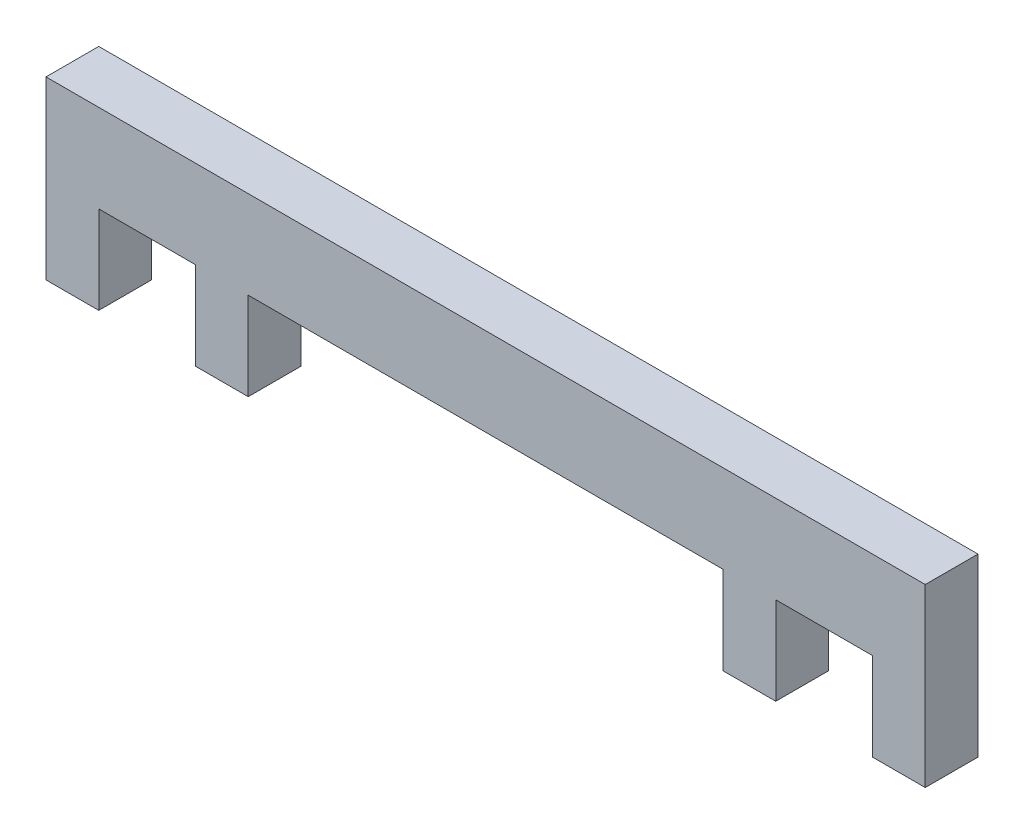
ISO-10303-21;
HEADER;
FILE_DESCRIPTION(('STEP AP214'),'2;1');
FILE_NAME('part.step','',(''),(''),'','','');
FILE_SCHEMA(('AUTOMOTIVE_DESIGN { 1 0 10303 214 1 1 1 1 }'));
ENDSEC;
DATA;
#1=APPLICATION_CONTEXT('core data for automotive mechanical design processes');
#2=APPLICATION_PROTOCOL_DEFINITION('international standard','automotive_design',2000,#1);
#3=PRODUCT_CONTEXT('',#1,'mechanical');
#4=PRODUCT('Part','Part','',(#3));
#5=PRODUCT_RELATED_PRODUCT_CATEGORY('part','',(#4));
#6=PRODUCT_DEFINITION_FORMATION('','',#4);
#7=PRODUCT_DEFINITION_CONTEXT('part definition',#1,'design');
#8=PRODUCT_DEFINITION('design','',#6,#7);
#9=PRODUCT_DEFINITION_SHAPE('','',#8);
#10=(LENGTH_UNIT() NAMED_UNIT(*) SI_UNIT(.MILLI.,.METRE.));
#11=(NAMED_UNIT(*) PLANE_ANGLE_UNIT() SI_UNIT($,.RADIAN.));
#12=(NAMED_UNIT(*) SI_UNIT($,.STERADIAN.) SOLID_ANGLE_UNIT());
#13=UNCERTAINTY_MEASURE_WITH_UNIT(LENGTH_MEASURE(1.E-05),#10,'distance_accuracy_value','');
#14=(GEOMETRIC_REPRESENTATION_CONTEXT(3) GLOBAL_UNCERTAINTY_ASSIGNED_CONTEXT((#13)) GLOBAL_UNIT_ASSIGNED_CONTEXT((#10,
#11,#12)) REPRESENTATION_CONTEXT('',''));
#15=CARTESIAN_POINT('',(0.,0.,0.));
#16=DIRECTION('',(0.,0.,1.));
#17=DIRECTION('',(1.,0.,0.));
#18=AXIS2_PLACEMENT_3D('',#15,#16,#17);
#19=CARTESIAN_POINT('',(0.,5.,3.));
#20=DIRECTION('',(-1.,0.,0.));
#21=DIRECTION('',(0.,-1.,0.));
#22=AXIS2_PLACEMENT_3D('',#19,#20,#21);
#23=PLANE('',#22);
#24=DIRECTION('',(0.,1.,0.));
#25=VECTOR('',#24,1.);
#26=CARTESIAN_POINT('',(0.,5.,0.));
#27=LINE('',#26,#25);
#28=CARTESIAN_POINT('',(0.,0.,0.));
#29=VERTEX_POINT('',#28);
#30=CARTESIAN_POINT('',(0.,5.,0.));
#31=VERTEX_POINT('',#30);
#32=EDGE_CURVE('E194',#29,#31,#27,.T.);
#33=ORIENTED_EDGE('',*,*,#32,.T.);
#34=DIRECTION('',(0.,0.,-1.));
#35=VECTOR('',#34,1.);
#36=CARTESIAN_POINT('',(0.,5.,3.));
#37=LINE('',#36,#35);
#38=CARTESIAN_POINT('',(0.,5.,3.));
#39=VERTEX_POINT('',#38);
#40=EDGE_CURVE('E11',#39,#31,#37,.T.);
#41=ORIENTED_EDGE('',*,*,#40,.F.);
#42=DIRECTION('',(0.,1.,0.));
#43=VECTOR('',#42,1.);
#44=CARTESIAN_POINT('',(0.,5.,3.));
#45=LINE('',#44,#43);
#46=CARTESIAN_POINT('',(0.,0.,3.));
#47=VERTEX_POINT('',#46);
#48=EDGE_CURVE('E240',#47,#39,#45,.T.);
#49=ORIENTED_EDGE('',*,*,#48,.F.);
#50=DIRECTION('',(0.,0.,-1.));
#51=VECTOR('',#50,1.);
#52=CARTESIAN_POINT('',(0.,0.,3.));
#53=LINE('',#52,#51);
#54=EDGE_CURVE('E190',#47,#29,#53,.T.);
#55=ORIENTED_EDGE('',*,*,#54,.T.);
#56=EDGE_LOOP('',(#33,#41,#49,#55));
#57=FACE_BOUND('',#56,.T.);
#58=ADVANCED_FACE('F45',(#57),#23,.F.);
#59=CARTESIAN_POINT('',(5.5,5.,3.));
#60=DIRECTION('',(0.,1.,0.));
#61=DIRECTION('',(-1.,0.,0.));
#62=AXIS2_PLACEMENT_3D('',#59,#60,#61);
#63=PLANE('',#62);
#64=DIRECTION('',(1.,0.,0.));
#65=VECTOR('',#64,1.);
#66=CARTESIAN_POINT('',(5.5,5.,0.));
#67=LINE('',#66,#65);
#68=CARTESIAN_POINT('',(5.5,5.,0.));
#69=VERTEX_POINT('',#68);
#70=EDGE_CURVE('E198',#31,#69,#67,.T.);
#71=ORIENTED_EDGE('',*,*,#70,.T.);
#72=DIRECTION('',(0.,0.,-1.));
#73=VECTOR('',#72,1.);
#74=CARTESIAN_POINT('',(5.5,5.,3.));
#75=LINE('',#74,#73);
#76=CARTESIAN_POINT('',(5.5,5.,3.));
#77=VERTEX_POINT('',#76);
#78=EDGE_CURVE('E54',#77,#69,#75,.T.);
#79=ORIENTED_EDGE('',*,*,#78,.F.);
#80=DIRECTION('',(1.,0.,0.));
#81=VECTOR('',#80,1.);
#82=CARTESIAN_POINT('',(5.5,5.,3.));
#83=LINE('',#82,#81);
#84=EDGE_CURVE('E129',#39,#77,#83,.T.);
#85=ORIENTED_EDGE('',*,*,#84,.F.);
#86=ORIENTED_EDGE('',*,*,#40,.T.);
#87=EDGE_LOOP('',(#71,#79,#85,#86));
#88=FACE_BOUND('',#87,.T.);
#89=ADVANCED_FACE('F362',(#88),#63,.F.);
#90=CARTESIAN_POINT('',(5.5,0.,3.));
#91=DIRECTION('',(1.,0.,0.));
#92=DIRECTION('',(0.,1.,0.));
#93=AXIS2_PLACEMENT_3D('',#90,#91,#92);
#94=PLANE('',#93);
#95=DIRECTION('',(0.,-1.,0.));
#96=VECTOR('',#95,1.);
#97=CARTESIAN_POINT('',(5.5,0.,0.));
#98=LINE('',#97,#96);
#99=CARTESIAN_POINT('',(5.5,0.,0.));
#100=VERTEX_POINT('',#99);
#101=EDGE_CURVE('E201',#69,#100,#98,.T.);
#102=ORIENTED_EDGE('',*,*,#101,.T.);
#103=DIRECTION('',(0.,0.,-1.));
#104=VECTOR('',#103,1.);
#105=CARTESIAN_POINT('',(5.5,0.,3.));
#106=LINE('',#105,#104);
#107=CARTESIAN_POINT('',(5.5,0.,3.));
#108=VERTEX_POINT('',#107);
#109=EDGE_CURVE('E283',#108,#100,#106,.T.);
#110=ORIENTED_EDGE('',*,*,#109,.F.);
#111=DIRECTION('',(0.,-1.,0.));
#112=VECTOR('',#111,1.);
#113=CARTESIAN_POINT('',(5.5,0.,3.));
#114=LINE('',#113,#112);
#115=EDGE_CURVE('E293',#77,#108,#114,.T.);
#116=ORIENTED_EDGE('',*,*,#115,.F.);
#117=ORIENTED_EDGE('',*,*,#78,.T.);
#118=EDGE_LOOP('',(#102,#110,#116,#117));
#119=FACE_BOUND('',#118,.T.);
#120=ADVANCED_FACE('F291',(#119),#94,.F.);
#121=CARTESIAN_POINT('',(8.5,0.,3.));
#122=DIRECTION('',(0.,1.,0.));
#123=DIRECTION('',(-1.,0.,0.));
#124=AXIS2_PLACEMENT_3D('',#121,#122,#123);
#125=PLANE('',#124);
#126=DIRECTION('',(1.,0.,0.));
#127=VECTOR('',#126,1.);
#128=CARTESIAN_POINT('',(8.5,0.,0.));
#129=LINE('',#128,#127);
#130=CARTESIAN_POINT('',(8.5,0.,0.));
#131=VERTEX_POINT('',#130);
#132=EDGE_CURVE('E204',#100,#131,#129,.T.);
#133=ORIENTED_EDGE('',*,*,#132,.T.);
#134=DIRECTION('',(0.,0.,-1.));
#135=VECTOR('',#134,1.);
#136=CARTESIAN_POINT('',(8.5,0.,3.));
#137=LINE('',#136,#135);
#138=CARTESIAN_POINT('',(8.5,0.,3.));
#139=VERTEX_POINT('',#138);
#140=EDGE_CURVE('E279',#139,#131,#137,.T.);
#141=ORIENTED_EDGE('',*,*,#140,.F.);
#142=DIRECTION('',(1.,0.,0.));
#143=VECTOR('',#142,1.);
#144=CARTESIAN_POINT('',(8.5,0.,3.));
#145=LINE('',#144,#143);
#146=EDGE_CURVE('E312',#108,#139,#145,.T.);
#147=ORIENTED_EDGE('',*,*,#146,.F.);
#148=ORIENTED_EDGE('',*,*,#109,.T.);
#149=EDGE_LOOP('',(#133,#141,#147,#148));
#150=FACE_BOUND('',#149,.T.);
#151=ADVANCED_FACE('F302',(#150),#125,.F.);
#152=CARTESIAN_POINT('',(8.5,5.,3.));
#153=DIRECTION('',(-1.,0.,0.));
#154=DIRECTION('',(0.,-1.,0.));
#155=AXIS2_PLACEMENT_3D('',#152,#153,#154);
#156=PLANE('',#155);
#157=DIRECTION('',(0.,1.,0.));
#158=VECTOR('',#157,1.);
#159=CARTESIAN_POINT('',(8.5,5.,0.));
#160=LINE('',#159,#158);
#161=CARTESIAN_POINT('',(8.5,5.,0.));
#162=VERTEX_POINT('',#161);
#163=EDGE_CURVE('E207',#131,#162,#160,.T.);
#164=ORIENTED_EDGE('',*,*,#163,.T.);
#165=DIRECTION('',(0.,0.,-1.));
#166=VECTOR('',#165,1.);
#167=CARTESIAN_POINT('',(8.5,5.,3.));
#168=LINE('',#167,#166);
#169=CARTESIAN_POINT('',(8.5,5.,3.));
#170=VERTEX_POINT('',#169);
#171=EDGE_CURVE('E275',#170,#162,#168,.T.);
#172=ORIENTED_EDGE('',*,*,#171,.F.);
#173=DIRECTION('',(0.,1.,0.));
#174=VECTOR('',#173,1.);
#175=CARTESIAN_POINT('',(8.5,5.,3.));
#176=LINE('',#175,#174);
#177=EDGE_CURVE('E308',#139,#170,#176,.T.);
#178=ORIENTED_EDGE('',*,*,#177,.F.);
#179=ORIENTED_EDGE('',*,*,#140,.T.);
#180=EDGE_LOOP('',(#164,#172,#178,#179));
#181=FACE_BOUND('',#180,.T.);
#182=ADVANCED_FACE('F306',(#181),#156,.F.);
#183=CARTESIAN_POINT('',(35.5,5.,3.));
#184=DIRECTION('',(0.,1.,0.));
#185=DIRECTION('',(-1.,0.,0.));
#186=AXIS2_PLACEMENT_3D('',#183,#184,#185);
#187=PLANE('',#186);
#188=DIRECTION('',(1.,0.,0.));
#189=VECTOR('',#188,1.);
#190=CARTESIAN_POINT('',(35.5,5.,0.));
#191=LINE('',#190,#189);
#192=CARTESIAN_POINT('',(35.5,5.,0.));
#193=VERTEX_POINT('',#192);
#194=EDGE_CURVE('E210',#162,#193,#191,.T.);
#195=ORIENTED_EDGE('',*,*,#194,.T.);
#196=DIRECTION('',(0.,0.,-1.));
#197=VECTOR('',#196,1.);
#198=CARTESIAN_POINT('',(35.5,5.,3.));
#199=LINE('',#198,#197);
#200=CARTESIAN_POINT('',(35.5,5.,3.));
#201=VERTEX_POINT('',#200);
#202=EDGE_CURVE('E271',#201,#193,#199,.T.);
#203=ORIENTED_EDGE('',*,*,#202,.F.);
#204=DIRECTION('',(1.,0.,0.));
#205=VECTOR('',#204,1.);
#206=CARTESIAN_POINT('',(35.5,5.,3.));
#207=LINE('',#206,#205);
#208=EDGE_CURVE('E311',#170,#201,#207,.T.);
#209=ORIENTED_EDGE('',*,*,#208,.F.);
#210=ORIENTED_EDGE('',*,*,#171,.T.);
#211=EDGE_LOOP('',(#195,#203,#209,#210));
#212=FACE_BOUND('',#211,.T.);
#213=ADVANCED_FACE('F375',(#212),#187,.F.);
#214=CARTESIAN_POINT('',(35.5,0.,3.));
#215=DIRECTION('',(1.,0.,0.));
#216=DIRECTION('',(0.,0.,-1.));
#217=AXIS2_PLACEMENT_3D('',#214,#215,#216);
#218=PLANE('',#217);
#219=DIRECTION('',(0.,-1.,0.));
#220=VECTOR('',#219,1.);
#221=CARTESIAN_POINT('',(35.5,0.,0.));
#222=LINE('',#221,#220);
#223=CARTESIAN_POINT('',(35.5,0.,0.));
#224=VERTEX_POINT('',#223);
#225=EDGE_CURVE('E213',#193,#224,#222,.T.);
#226=ORIENTED_EDGE('',*,*,#225,.T.);
#227=DIRECTION('',(0.,0.,-1.));
#228=VECTOR('',#227,1.);
#229=CARTESIAN_POINT('',(35.5,0.,3.));
#230=LINE('',#229,#228);
#231=CARTESIAN_POINT('',(35.5,0.,3.));
#232=VERTEX_POINT('',#231);
#233=EDGE_CURVE('E267',#232,#224,#230,.T.);
#234=ORIENTED_EDGE('',*,*,#233,.F.);
#235=DIRECTION('',(0.,-1.,0.));
#236=VECTOR('',#235,1.);
#237=CARTESIAN_POINT('',(35.5,0.,3.));
#238=LINE('',#237,#236);
#239=EDGE_CURVE('E316',#201,#232,#238,.T.);
#240=ORIENTED_EDGE('',*,*,#239,.F.);
#241=ORIENTED_EDGE('',*,*,#202,.T.);
#242=EDGE_LOOP('',(#226,#234,#240,#241));
#243=FACE_BOUND('',#242,.T.);
#244=ADVANCED_FACE('F378',(#243),#218,.F.);
#245=CARTESIAN_POINT('',(38.5,0.,3.));
#246=DIRECTION('',(0.,1.,0.));
#247=DIRECTION('',(-1.,0.,0.));
#248=AXIS2_PLACEMENT_3D('',#245,#246,#247);
#249=PLANE('',#248);
#250=DIRECTION('',(1.,0.,0.));
#251=VECTOR('',#250,1.);
#252=CARTESIAN_POINT('',(38.5,0.,0.));
#253=LINE('',#252,#251);
#254=CARTESIAN_POINT('',(38.5,0.,0.));
#255=VERTEX_POINT('',#254);
#256=EDGE_CURVE('E216',#224,#255,#253,.T.);
#257=ORIENTED_EDGE('',*,*,#256,.T.);
#258=DIRECTION('',(0.,0.,-1.));
#259=VECTOR('',#258,1.);
#260=CARTESIAN_POINT('',(38.5,0.,3.));
#261=LINE('',#260,#259);
#262=CARTESIAN_POINT('',(38.5,0.,3.));
#263=VERTEX_POINT('',#262);
#264=EDGE_CURVE('E263',#263,#255,#261,.T.);
#265=ORIENTED_EDGE('',*,*,#264,.F.);
#266=DIRECTION('',(1.,0.,0.));
#267=VECTOR('',#266,1.);
#268=CARTESIAN_POINT('',(38.5,0.,3.));
#269=LINE('',#268,#267);
#270=EDGE_CURVE('E323',#232,#263,#269,.T.);
#271=ORIENTED_EDGE('',*,*,#270,.F.);
#272=ORIENTED_EDGE('',*,*,#233,.T.);
#273=EDGE_LOOP('',(#257,#265,#271,#272));
#274=FACE_BOUND('',#273,.T.);
#275=ADVANCED_FACE('F382',(#274),#249,.F.);
#276=CARTESIAN_POINT('',(38.5,5.,3.));
#277=DIRECTION('',(-1.,0.,0.));
#278=DIRECTION('',(0.,0.,1.));
#279=AXIS2_PLACEMENT_3D('',#276,#277,#278);
#280=PLANE('',#279);
#281=DIRECTION('',(0.,1.,0.));
#282=VECTOR('',#281,1.);
#283=CARTESIAN_POINT('',(38.5,5.,0.));
#284=LINE('',#283,#282);
#285=CARTESIAN_POINT('',(38.5,5.,0.));
#286=VERTEX_POINT('',#285);
#287=EDGE_CURVE('E219',#255,#286,#284,.T.);
#288=ORIENTED_EDGE('',*,*,#287,.T.);
#289=DIRECTION('',(0.,0.,-1.));
#290=VECTOR('',#289,1.);
#291=CARTESIAN_POINT('',(38.5,5.,3.));
#292=LINE('',#291,#290);
#293=CARTESIAN_POINT('',(38.5,5.,3.));
#294=VERTEX_POINT('',#293);
#295=EDGE_CURVE('E259',#294,#286,#292,.T.);
#296=ORIENTED_EDGE('',*,*,#295,.F.);
#297=DIRECTION('',(0.,1.,0.));
#298=VECTOR('',#297,1.);
#299=CARTESIAN_POINT('',(38.5,5.,3.));
#300=LINE('',#299,#298);
#301=EDGE_CURVE('E326',#263,#294,#300,.T.);
#302=ORIENTED_EDGE('',*,*,#301,.F.);
#303=ORIENTED_EDGE('',*,*,#264,.T.);
#304=EDGE_LOOP('',(#288,#296,#302,#303));
#305=FACE_BOUND('',#304,.T.);
#306=ADVANCED_FACE('F386',(#305),#280,.F.);
#307=CARTESIAN_POINT('',(44.,5.,3.));
#308=DIRECTION('',(0.,1.,0.));
#309=DIRECTION('',(0.,0.,1.));
#310=AXIS2_PLACEMENT_3D('',#307,#308,#309);
#311=PLANE('',#310);
#312=DIRECTION('',(1.,0.,0.));
#313=VECTOR('',#312,1.);
#314=CARTESIAN_POINT('',(44.,5.,0.));
#315=LINE('',#314,#313);
#316=CARTESIAN_POINT('',(44.,5.,0.));
#317=VERTEX_POINT('',#316);
#318=EDGE_CURVE('E222',#286,#317,#315,.T.);
#319=ORIENTED_EDGE('',*,*,#318,.T.);
#320=DIRECTION('',(0.,0.,-1.));
#321=VECTOR('',#320,1.);
#322=CARTESIAN_POINT('',(44.,5.,3.));
#323=LINE('',#322,#321);
#324=CARTESIAN_POINT('',(44.,5.,3.));
#325=VERTEX_POINT('',#324);
#326=EDGE_CURVE('E255',#325,#317,#323,.T.);
#327=ORIENTED_EDGE('',*,*,#326,.F.);
#328=DIRECTION('',(1.,0.,0.));
#329=VECTOR('',#328,1.);
#330=CARTESIAN_POINT('',(44.,5.,3.));
#331=LINE('',#330,#329);
#332=EDGE_CURVE('E329',#294,#325,#331,.T.);
#333=ORIENTED_EDGE('',*,*,#332,.F.);
#334=ORIENTED_EDGE('',*,*,#295,.T.);
#335=EDGE_LOOP('',(#319,#327,#333,#334));
#336=FACE_BOUND('',#335,.T.);
#337=ADVANCED_FACE('F390',(#336),#311,.F.);
#338=CARTESIAN_POINT('',(44.,0.,3.));
#339=DIRECTION('',(1.,0.,0.));
#340=DIRECTION('',(0.,0.,-1.));
#341=AXIS2_PLACEMENT_3D('',#338,#339,#340);
#342=PLANE('',#341);
#343=DIRECTION('',(0.,-1.,0.));
#344=VECTOR('',#343,1.);
#345=CARTESIAN_POINT('',(44.,0.,0.));
#346=LINE('',#345,#344);
#347=CARTESIAN_POINT('',(44.,0.,0.));
#348=VERTEX_POINT('',#347);
#349=EDGE_CURVE('E225',#317,#348,#346,.T.);
#350=ORIENTED_EDGE('',*,*,#349,.T.);
#351=DIRECTION('',(0.,0.,-1.));
#352=VECTOR('',#351,1.);
#353=CARTESIAN_POINT('',(44.,0.,3.));
#354=LINE('',#353,#352);
#355=CARTESIAN_POINT('',(44.,0.,3.));
#356=VERTEX_POINT('',#355);
#357=EDGE_CURVE('E251',#356,#348,#354,.T.);
#358=ORIENTED_EDGE('',*,*,#357,.F.);
#359=DIRECTION('',(0.,-1.,0.));
#360=VECTOR('',#359,1.);
#361=CARTESIAN_POINT('',(44.,0.,3.));
#362=LINE('',#361,#360);
#363=EDGE_CURVE('E332',#325,#356,#362,.T.);
#364=ORIENTED_EDGE('',*,*,#363,.F.);
#365=ORIENTED_EDGE('',*,*,#326,.T.);
#366=EDGE_LOOP('',(#350,#358,#364,#365));
#367=FACE_BOUND('',#366,.T.);
#368=ADVANCED_FACE('F394',(#367),#342,.F.);
#369=CARTESIAN_POINT('',(47.,0.,3.));
#370=DIRECTION('',(0.,1.,0.));
#371=DIRECTION('',(-1.,0.,0.));
#372=AXIS2_PLACEMENT_3D('',#369,#370,#371);
#373=PLANE('',#372);
#374=DIRECTION('',(1.,0.,0.));
#375=VECTOR('',#374,1.);
#376=CARTESIAN_POINT('',(47.,0.,0.));
#377=LINE('',#376,#375);
#378=CARTESIAN_POINT('',(47.,0.,0.));
#379=VERTEX_POINT('',#378);
#380=EDGE_CURVE('E228',#348,#379,#377,.T.);
#381=ORIENTED_EDGE('',*,*,#380,.T.);
#382=DIRECTION('',(0.,0.,-1.));
#383=VECTOR('',#382,1.);
#384=CARTESIAN_POINT('',(47.,0.,3.));
#385=LINE('',#384,#383);
#386=CARTESIAN_POINT('',(47.,0.,3.));
#387=VERTEX_POINT('',#386);
#388=EDGE_CURVE('E247',#387,#379,#385,.T.);
#389=ORIENTED_EDGE('',*,*,#388,.F.);
#390=DIRECTION('',(1.,0.,0.));
#391=VECTOR('',#390,1.);
#392=CARTESIAN_POINT('',(47.,0.,3.));
#393=LINE('',#392,#391);
#394=EDGE_CURVE('E335',#356,#387,#393,.T.);
#395=ORIENTED_EDGE('',*,*,#394,.F.);
#396=ORIENTED_EDGE('',*,*,#357,.T.);
#397=EDGE_LOOP('',(#381,#389,#395,#396));
#398=FACE_BOUND('',#397,.T.);
#399=ADVANCED_FACE('F343',(#398),#373,.F.);
#400=CARTESIAN_POINT('',(47.,10.,3.));
#401=DIRECTION('',(-1.,0.,0.));
#402=DIRECTION('',(0.,0.,1.));
#403=AXIS2_PLACEMENT_3D('',#400,#401,#402);
#404=PLANE('',#403);
#405=DIRECTION('',(0.,1.,0.));
#406=VECTOR('',#405,1.);
#407=CARTESIAN_POINT('',(47.,10.,0.));
#408=LINE('',#407,#406);
#409=CARTESIAN_POINT('',(47.,10.,0.));
#410=VERTEX_POINT('',#409);
#411=EDGE_CURVE('E231',#379,#410,#408,.T.);
#412=ORIENTED_EDGE('',*,*,#411,.T.);
#413=DIRECTION('',(0.,0.,-1.));
#414=VECTOR('',#413,1.);
#415=CARTESIAN_POINT('',(47.,10.,3.));
#416=LINE('',#415,#414);
#417=CARTESIAN_POINT('',(47.,10.,3.));
#418=VERTEX_POINT('',#417);
#419=EDGE_CURVE('E183',#418,#410,#416,.T.);
#420=ORIENTED_EDGE('',*,*,#419,.F.);
#421=DIRECTION('',(0.,1.,0.));
#422=VECTOR('',#421,1.);
#423=CARTESIAN_POINT('',(47.,10.,3.));
#424=LINE('',#423,#422);
#425=EDGE_CURVE('E172',#387,#418,#424,.T.);
#426=ORIENTED_EDGE('',*,*,#425,.F.);
#427=ORIENTED_EDGE('',*,*,#388,.T.);
#428=EDGE_LOOP('',(#412,#420,#426,#427));
#429=FACE_BOUND('',#428,.T.);
#430=ADVANCED_FACE('F347',(#429),#404,.F.);
#431=CARTESIAN_POINT('',(-3.,10.,3.));
#432=DIRECTION('',(0.,-1.,0.));
#433=DIRECTION('',(1.,0.,0.));
#434=AXIS2_PLACEMENT_3D('',#431,#432,#433);
#435=PLANE('',#434);
#436=DIRECTION('',(-1.,0.,0.));
#437=VECTOR('',#436,1.);
#438=CARTESIAN_POINT('',(-3.,10.,0.));
#439=LINE('',#438,#437);
#440=CARTESIAN_POINT('',(-3.,10.,0.));
#441=VERTEX_POINT('',#440);
#442=EDGE_CURVE('E181',#410,#441,#439,.T.);
#443=ORIENTED_EDGE('',*,*,#442,.T.);
#444=DIRECTION('',(0.,0.,-1.));
#445=VECTOR('',#444,1.);
#446=CARTESIAN_POINT('',(-3.,10.,3.));
#447=LINE('',#446,#445);
#448=CARTESIAN_POINT('',(-3.,10.,3.));
#449=VERTEX_POINT('',#448);
#450=EDGE_CURVE('E178',#449,#441,#447,.T.);
#451=ORIENTED_EDGE('',*,*,#450,.F.);
#452=DIRECTION('',(-1.,0.,0.));
#453=VECTOR('',#452,1.);
#454=CARTESIAN_POINT('',(-3.,10.,3.));
#455=LINE('',#454,#453);
#456=EDGE_CURVE('E166',#418,#449,#455,.T.);
#457=ORIENTED_EDGE('',*,*,#456,.F.);
#458=ORIENTED_EDGE('',*,*,#419,.T.);
#459=EDGE_LOOP('',(#443,#451,#457,#458));
#460=FACE_BOUND('',#459,.T.);
#461=ADVANCED_FACE('F179',(#460),#435,.F.);
#462=CARTESIAN_POINT('',(-3.,0.,3.));
#463=DIRECTION('',(1.,0.,0.));
#464=DIRECTION('',(0.,1.,0.));
#465=AXIS2_PLACEMENT_3D('',#462,#463,#464);
#466=PLANE('',#465);
#467=DIRECTION('',(0.,-1.,0.));
#468=VECTOR('',#467,1.);
#469=CARTESIAN_POINT('',(-3.,0.,0.));
#470=LINE('',#469,#468);
#471=CARTESIAN_POINT('',(-3.,0.,0.));
#472=VERTEX_POINT('',#471);
#473=EDGE_CURVE('E115',#441,#472,#470,.T.);
#474=ORIENTED_EDGE('',*,*,#473,.T.);
#475=DIRECTION('',(0.,0.,-1.));
#476=VECTOR('',#475,1.);
#477=CARTESIAN_POINT('',(-3.,0.,3.));
#478=LINE('',#477,#476);
#479=CARTESIAN_POINT('',(-3.,0.,3.));
#480=VERTEX_POINT('',#479);
#481=EDGE_CURVE('E184',#480,#472,#478,.T.);
#482=ORIENTED_EDGE('',*,*,#481,.F.);
#483=DIRECTION('',(0.,-1.,0.));
#484=VECTOR('',#483,1.);
#485=CARTESIAN_POINT('',(-3.,0.,3.));
#486=LINE('',#485,#484);
#487=EDGE_CURVE('E170',#449,#480,#486,.T.);
#488=ORIENTED_EDGE('',*,*,#487,.F.);
#489=ORIENTED_EDGE('',*,*,#450,.T.);
#490=EDGE_LOOP('',(#474,#482,#488,#489));
#491=FACE_BOUND('',#490,.T.);
#492=ADVANCED_FACE('F186',(#491),#466,.F.);
#493=CARTESIAN_POINT('',(0.,0.,3.));
#494=DIRECTION('',(0.,1.,0.));
#495=DIRECTION('',(-1.,0.,0.));
#496=AXIS2_PLACEMENT_3D('',#493,#494,#495);
#497=PLANE('',#496);
#498=DIRECTION('',(1.,0.,0.));
#499=VECTOR('',#498,1.);
#500=CARTESIAN_POINT('',(0.,0.,0.));
#501=LINE('',#500,#499);
#502=EDGE_CURVE('E121',#472,#29,#501,.T.);
#503=ORIENTED_EDGE('',*,*,#502,.T.);
#504=ORIENTED_EDGE('',*,*,#54,.F.);
#505=DIRECTION('',(1.,0.,0.));
#506=VECTOR('',#505,1.);
#507=CARTESIAN_POINT('',(0.,0.,3.));
#508=LINE('',#507,#506);
#509=EDGE_CURVE('E62',#480,#47,#508,.T.);
#510=ORIENTED_EDGE('',*,*,#509,.F.);
#511=ORIENTED_EDGE('',*,*,#481,.T.);
#512=EDGE_LOOP('',(#503,#504,#510,#511));
#513=FACE_BOUND('',#512,.T.);
#514=ADVANCED_FACE('F351',(#513),#497,.F.);
#515=CARTESIAN_POINT('',(0.,0.,3.));
#516=DIRECTION('',(0.,0.,-1.));
#517=DIRECTION('',(-1.,0.,0.));
#518=AXIS2_PLACEMENT_3D('',#515,#516,#517);
#519=PLANE('',#518);
#520=ORIENTED_EDGE('',*,*,#48,.T.);
#521=ORIENTED_EDGE('',*,*,#84,.T.);
#522=ORIENTED_EDGE('',*,*,#115,.T.);
#523=ORIENTED_EDGE('',*,*,#146,.T.);
#524=ORIENTED_EDGE('',*,*,#177,.T.);
#525=ORIENTED_EDGE('',*,*,#208,.T.);
#526=ORIENTED_EDGE('',*,*,#239,.T.);
#527=ORIENTED_EDGE('',*,*,#270,.T.);
#528=ORIENTED_EDGE('',*,*,#301,.T.);
#529=ORIENTED_EDGE('',*,*,#332,.T.);
#530=ORIENTED_EDGE('',*,*,#363,.T.);
#531=ORIENTED_EDGE('',*,*,#394,.T.);
#532=ORIENTED_EDGE('',*,*,#425,.T.);
#533=ORIENTED_EDGE('',*,*,#456,.T.);
#534=ORIENTED_EDGE('',*,*,#487,.T.);
#535=ORIENTED_EDGE('',*,*,#509,.T.);
#536=EDGE_LOOP('',(#520,#521,#522,#523,#524,#525,#526,#527,#528,#529,#530,#531,#532,#533,#534,#535));
#537=FACE_BOUND('',#536,.T.);
#538=ADVANCED_FACE('F168',(#537),#519,.F.);
#539=CARTESIAN_POINT('',(0.,0.,0.));
#540=DIRECTION('',(0.,0.,-1.));
#541=DIRECTION('',(-1.,0.,0.));
#542=AXIS2_PLACEMENT_3D('',#539,#540,#541);
#543=PLANE('',#542);
#544=ORIENTED_EDGE('',*,*,#32,.F.);
#545=ORIENTED_EDGE('',*,*,#502,.F.);
#546=ORIENTED_EDGE('',*,*,#473,.F.);
#547=ORIENTED_EDGE('',*,*,#442,.F.);
#548=ORIENTED_EDGE('',*,*,#411,.F.);
#549=ORIENTED_EDGE('',*,*,#380,.F.);
#550=ORIENTED_EDGE('',*,*,#349,.F.);
#551=ORIENTED_EDGE('',*,*,#318,.F.);
#552=ORIENTED_EDGE('',*,*,#287,.F.);
#553=ORIENTED_EDGE('',*,*,#256,.F.);
#554=ORIENTED_EDGE('',*,*,#225,.F.);
#555=ORIENTED_EDGE('',*,*,#194,.F.);
#556=ORIENTED_EDGE('',*,*,#163,.F.);
#557=ORIENTED_EDGE('',*,*,#132,.F.);
#558=ORIENTED_EDGE('',*,*,#101,.F.);
#559=ORIENTED_EDGE('',*,*,#70,.F.);
#560=EDGE_LOOP('',(#544,#545,#546,#547,#548,#549,#550,#551,#552,#553,#554,#555,#556,#557,#558,#559));
#561=FACE_BOUND('',#560,.T.);
#562=ADVANCED_FACE('F297',(#561),#543,.T.);
#563=CLOSED_SHELL('',(#58,#89,#120,#151,#182,#213,#244,#275,#306,#337,#368,#399,#430,#461,#492,
#514,#538,#562));
#564=MANIFOLD_SOLID_BREP('B2',#563);
#565=ADVANCED_BREP_SHAPE_REPRESENTATION('',(#18,#564),#14);
#566=SHAPE_DEFINITION_REPRESENTATION(#9,#565);
ENDSEC;
END-ISO-10303-21;
